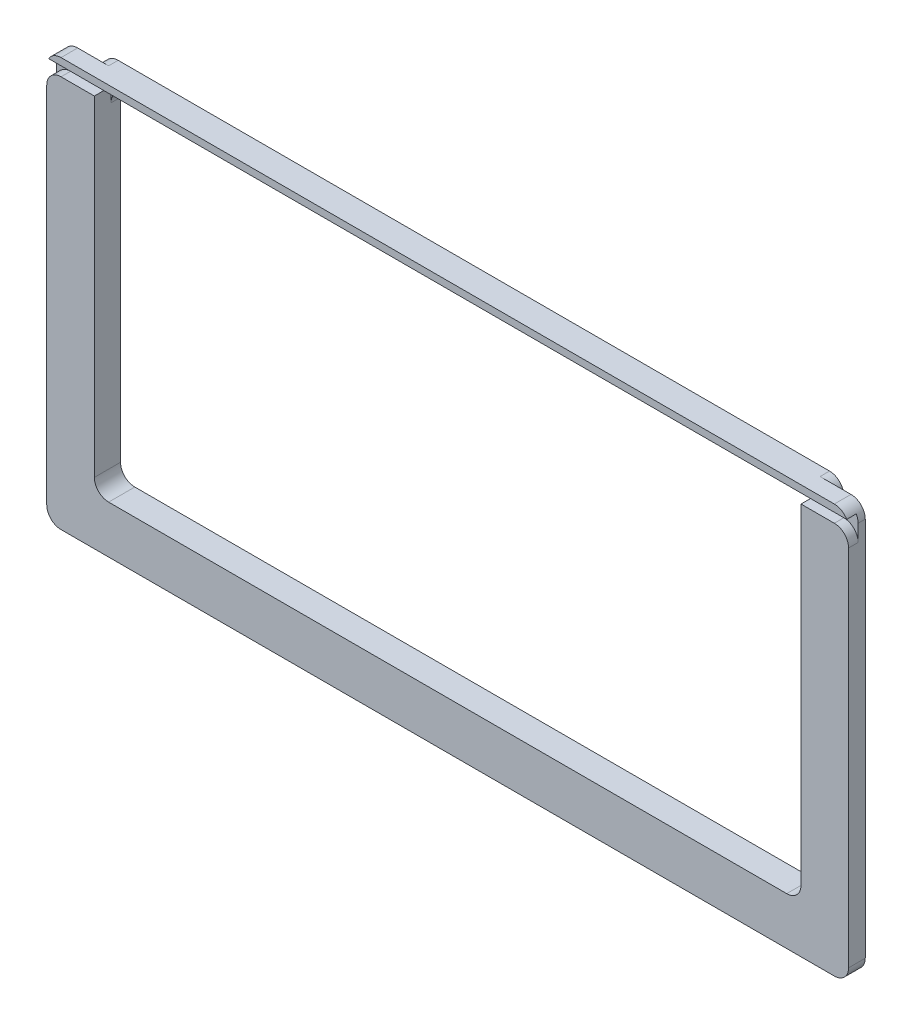
ISO-10303-21;
HEADER;
FILE_DESCRIPTION(('STEP AP214'),'2;1');
FILE_NAME('part.step','',(''),(''),'','','');
FILE_SCHEMA(('AUTOMOTIVE_DESIGN { 1 0 10303 214 1 1 1 1 }'));
ENDSEC;
DATA;
#1=APPLICATION_CONTEXT('core data for automotive mechanical design processes');
#2=APPLICATION_PROTOCOL_DEFINITION('international standard','automotive_design',2000,#1);
#3=PRODUCT_CONTEXT('',#1,'mechanical');
#4=PRODUCT('Part','Part','',(#3));
#5=PRODUCT_RELATED_PRODUCT_CATEGORY('part','',(#4));
#6=PRODUCT_DEFINITION_FORMATION('','',#4);
#7=PRODUCT_DEFINITION_CONTEXT('part definition',#1,'design');
#8=PRODUCT_DEFINITION('design','',#6,#7);
#9=PRODUCT_DEFINITION_SHAPE('','',#8);
#10=(LENGTH_UNIT() NAMED_UNIT(*) SI_UNIT(.MILLI.,.METRE.));
#11=(NAMED_UNIT(*) PLANE_ANGLE_UNIT() SI_UNIT($,.RADIAN.));
#12=(NAMED_UNIT(*) SI_UNIT($,.STERADIAN.) SOLID_ANGLE_UNIT());
#13=UNCERTAINTY_MEASURE_WITH_UNIT(LENGTH_MEASURE(1.E-05),#10,'distance_accuracy_value','');
#14=(GEOMETRIC_REPRESENTATION_CONTEXT(3) GLOBAL_UNCERTAINTY_ASSIGNED_CONTEXT((#13)) GLOBAL_UNIT_ASSIGNED_CONTEXT((#10,
#11,#12)) REPRESENTATION_CONTEXT('',''));
#15=CARTESIAN_POINT('',(0.,0.,0.));
#16=DIRECTION('',(0.,0.,1.));
#17=DIRECTION('',(1.,0.,0.));
#18=AXIS2_PLACEMENT_3D('',#15,#16,#17);
#19=CARTESIAN_POINT('',(0.,0.,3.5));
#20=DIRECTION('',(0.,0.,-1.));
#21=DIRECTION('',(-1.,0.,0.));
#22=AXIS2_PLACEMENT_3D('',#19,#20,#21);
#23=PLANE('',#22);
#24=DIRECTION('',(-1.,0.,0.));
#25=VECTOR('',#24,1.);
#26=CARTESIAN_POINT('',(84.245,42.95,3.5));
#27=LINE('',#26,#25);
#28=CARTESIAN_POINT('',(81.245,42.95,3.5));
#29=VERTEX_POINT('',#28);
#30=CARTESIAN_POINT('',(-81.245,42.95,3.5));
#31=VERTEX_POINT('',#30);
#32=EDGE_CURVE('E305',#29,#31,#27,.T.);
#33=ORIENTED_EDGE('',*,*,#32,.T.);
#34=CARTESIAN_POINT('',(-81.245,39.95,3.5));
#35=DIRECTION('',(0.,0.,-1.));
#36=DIRECTION('',(-1.,0.,0.));
#37=AXIS2_PLACEMENT_3D('',#34,#35,#36);
#38=CIRCLE('',#37,3.);
#39=CARTESIAN_POINT('',(-83.8430762113533,41.45,3.5));
#40=VERTEX_POINT('',#39);
#41=EDGE_CURVE('E368',#31,#40,#38,.F.);
#42=ORIENTED_EDGE('',*,*,#41,.T.);
#43=DIRECTION('',(1.,0.,0.));
#44=VECTOR('',#43,1.);
#45=CARTESIAN_POINT('',(-78.052886552932,41.45,3.5));
#46=LINE('',#45,#44);
#47=CARTESIAN_POINT('',(83.8430762113533,41.45,3.5));
#48=VERTEX_POINT('',#47);
#49=EDGE_CURVE('E269',#40,#48,#46,.T.);
#50=ORIENTED_EDGE('',*,*,#49,.T.);
#51=CARTESIAN_POINT('',(81.245,39.95,3.5));
#52=DIRECTION('',(0.,0.,-1.));
#53=DIRECTION('',(-1.,0.,0.));
#54=AXIS2_PLACEMENT_3D('',#51,#52,#53);
#55=CIRCLE('',#54,3.);
#56=EDGE_CURVE('E366',#48,#29,#55,.F.);
#57=ORIENTED_EDGE('',*,*,#56,.T.);
#58=EDGE_LOOP('',(#33,#42,#50,#57));
#59=FACE_BOUND('',#58,.T.);
#60=ADVANCED_FACE('F38',(#59),#23,.F.);
#61=CARTESIAN_POINT('',(-74.245,42.95,0.));
#62=DIRECTION('',(-1.,0.,0.));
#63=DIRECTION('',(0.,-1.,0.));
#64=AXIS2_PLACEMENT_3D('',#61,#62,#63);
#65=PLANE('',#64);
#66=DIRECTION('',(0.,1.,0.));
#67=VECTOR('',#66,1.);
#68=CARTESIAN_POINT('',(-74.245,39.45,-2.));
#69=LINE('',#68,#67);
#70=CARTESIAN_POINT('',(-74.245,-29.95,-2.));
#71=VERTEX_POINT('',#70);
#72=CARTESIAN_POINT('',(-74.245,36.45,-2.));
#73=VERTEX_POINT('',#72);
#74=EDGE_CURVE('E575',#71,#73,#69,.T.);
#75=ORIENTED_EDGE('',*,*,#74,.T.);
#76=DIRECTION('',(0.,0.,1.));
#77=VECTOR('',#76,1.);
#78=CARTESIAN_POINT('',(-74.245,36.45,0.));
#79=LINE('',#78,#77);
#80=CARTESIAN_POINT('',(-74.245,36.45,0.));
#81=VERTEX_POINT('',#80);
#82=EDGE_CURVE('E419',#73,#81,#79,.T.);
#83=ORIENTED_EDGE('',*,*,#82,.T.);
#84=DIRECTION('',(0.,-1.,0.));
#85=VECTOR('',#84,1.);
#86=CARTESIAN_POINT('',(-74.245,42.95,0.));
#87=LINE('',#86,#85);
#88=CARTESIAN_POINT('',(-74.245,41.45,0.));
#89=VERTEX_POINT('',#88);
#90=EDGE_CURVE('E281',#89,#81,#87,.T.);
#91=ORIENTED_EDGE('',*,*,#90,.F.);
#92=DIRECTION('',(0.,0.,1.));
#93=VECTOR('',#92,1.);
#94=CARTESIAN_POINT('',(-74.245,41.45,3.5));
#95=LINE('',#94,#93);
#96=CARTESIAN_POINT('',(-74.245,41.45,1.5));
#97=VERTEX_POINT('',#96);
#98=EDGE_CURVE('E267',#89,#97,#95,.T.);
#99=ORIENTED_EDGE('',*,*,#98,.T.);
#100=DIRECTION('',(0.,-1.,0.));
#101=VECTOR('',#100,1.);
#102=CARTESIAN_POINT('',(-74.245,42.95,1.5));
#103=LINE('',#102,#101);
#104=CARTESIAN_POINT('',(-74.245,39.45,1.5));
#105=VERTEX_POINT('',#104);
#106=EDGE_CURVE('E528',#97,#105,#103,.T.);
#107=ORIENTED_EDGE('',*,*,#106,.T.);
#108=DIRECTION('',(0.,0.,1.));
#109=VECTOR('',#108,1.);
#110=CARTESIAN_POINT('',(-74.245,39.45,0.));
#111=LINE('',#110,#109);
#112=CARTESIAN_POINT('',(-74.245,39.45,3.5));
#113=VERTEX_POINT('',#112);
#114=EDGE_CURVE('E533',#105,#113,#111,.T.);
#115=ORIENTED_EDGE('',*,*,#114,.T.);
#116=DIRECTION('',(0.,-1.,0.));
#117=VECTOR('',#116,1.);
#118=CARTESIAN_POINT('',(-74.245,42.95,3.5));
#119=LINE('',#118,#117);
#120=CARTESIAN_POINT('',(-74.245,-29.95,3.5));
#121=VERTEX_POINT('',#120);
#122=EDGE_CURVE('E289',#113,#121,#119,.T.);
#123=ORIENTED_EDGE('',*,*,#122,.T.);
#124=DIRECTION('',(0.,0.,1.));
#125=VECTOR('',#124,1.);
#126=CARTESIAN_POINT('',(-74.245,-29.95,-2.));
#127=LINE('',#126,#125);
#128=EDGE_CURVE('E417',#121,#71,#127,.F.);
#129=ORIENTED_EDGE('',*,*,#128,.T.);
#130=EDGE_LOOP('',(#75,#83,#91,#99,#107,#115,#123,#129));
#131=FACE_BOUND('',#130,.T.);
#132=ADVANCED_FACE('F470',(#131),#65,.F.);
#133=CARTESIAN_POINT('',(74.245,42.95,0.));
#134=DIRECTION('',(1.,0.,0.));
#135=DIRECTION('',(0.,1.,0.));
#136=AXIS2_PLACEMENT_3D('',#133,#134,#135);
#137=PLANE('',#136);
#138=DIRECTION('',(0.,-1.,0.));
#139=VECTOR('',#138,1.);
#140=CARTESIAN_POINT('',(74.245,39.45,-2.));
#141=LINE('',#140,#139);
#142=CARTESIAN_POINT('',(74.245,36.45,-2.));
#143=VERTEX_POINT('',#142);
#144=CARTESIAN_POINT('',(74.245,-29.95,-2.));
#145=VERTEX_POINT('',#144);
#146=EDGE_CURVE('E451',#143,#145,#141,.T.);
#147=ORIENTED_EDGE('',*,*,#146,.T.);
#148=DIRECTION('',(0.,0.,1.));
#149=VECTOR('',#148,1.);
#150=CARTESIAN_POINT('',(74.245,-29.95,3.5));
#151=LINE('',#150,#149);
#152=CARTESIAN_POINT('',(74.245,-29.95,3.5));
#153=VERTEX_POINT('',#152);
#154=EDGE_CURVE('E434',#145,#153,#151,.T.);
#155=ORIENTED_EDGE('',*,*,#154,.T.);
#156=DIRECTION('',(0.,1.,0.));
#157=VECTOR('',#156,1.);
#158=CARTESIAN_POINT('',(74.245,42.95,3.5));
#159=LINE('',#158,#157);
#160=CARTESIAN_POINT('',(74.245,39.45,3.5));
#161=VERTEX_POINT('',#160);
#162=EDGE_CURVE('E285',#153,#161,#159,.T.);
#163=ORIENTED_EDGE('',*,*,#162,.T.);
#164=DIRECTION('',(0.,0.,-1.));
#165=VECTOR('',#164,1.);
#166=CARTESIAN_POINT('',(74.245,39.45,0.));
#167=LINE('',#166,#165);
#168=CARTESIAN_POINT('',(74.245,39.45,1.5));
#169=VERTEX_POINT('',#168);
#170=EDGE_CURVE('E531',#161,#169,#167,.T.);
#171=ORIENTED_EDGE('',*,*,#170,.T.);
#172=DIRECTION('',(0.,1.,0.));
#173=VECTOR('',#172,1.);
#174=CARTESIAN_POINT('',(74.245,42.95,1.5));
#175=LINE('',#174,#173);
#176=CARTESIAN_POINT('',(74.245,41.45,1.5));
#177=VERTEX_POINT('',#176);
#178=EDGE_CURVE('E275',#169,#177,#175,.T.);
#179=ORIENTED_EDGE('',*,*,#178,.T.);
#180=DIRECTION('',(0.,0.,1.));
#181=VECTOR('',#180,1.);
#182=CARTESIAN_POINT('',(74.245,41.45,3.5));
#183=LINE('',#182,#181);
#184=CARTESIAN_POINT('',(74.245,41.45,0.));
#185=VERTEX_POINT('',#184);
#186=EDGE_CURVE('E265',#185,#177,#183,.T.);
#187=ORIENTED_EDGE('',*,*,#186,.F.);
#188=DIRECTION('',(0.,1.,0.));
#189=VECTOR('',#188,1.);
#190=CARTESIAN_POINT('',(74.245,42.95,0.));
#191=LINE('',#190,#189);
#192=CARTESIAN_POINT('',(74.245,36.45,0.));
#193=VERTEX_POINT('',#192);
#194=EDGE_CURVE('E53',#193,#185,#191,.T.);
#195=ORIENTED_EDGE('',*,*,#194,.F.);
#196=DIRECTION('',(0.,0.,1.));
#197=VECTOR('',#196,1.);
#198=CARTESIAN_POINT('',(74.245,36.45,0.));
#199=LINE('',#198,#197);
#200=EDGE_CURVE('E432',#193,#143,#199,.F.);
#201=ORIENTED_EDGE('',*,*,#200,.T.);
#202=EDGE_LOOP('',(#147,#155,#163,#171,#179,#187,#195,#201));
#203=FACE_BOUND('',#202,.T.);
#204=ADVANCED_FACE('F273',(#203),#137,.F.);
#205=CARTESIAN_POINT('',(-84.245,42.95,3.5));
#206=DIRECTION('',(1.,0.,0.));
#207=DIRECTION('',(0.,0.,-1.));
#208=AXIS2_PLACEMENT_3D('',#205,#206,#207);
#209=PLANE('',#208);
#210=DIRECTION('',(0.,1.,0.));
#211=VECTOR('',#210,1.);
#212=CARTESIAN_POINT('',(-84.245,42.95,1.5));
#213=LINE('',#212,#211);
#214=CARTESIAN_POINT('',(-84.245,36.45,1.5));
#215=VERTEX_POINT('',#214);
#216=CARTESIAN_POINT('',(-84.245,39.95,1.5));
#217=VERTEX_POINT('',#216);
#218=EDGE_CURVE('E523',#215,#217,#213,.T.);
#219=ORIENTED_EDGE('',*,*,#218,.T.);
#220=DIRECTION('',(0.,0.,-1.));
#221=VECTOR('',#220,1.);
#222=CARTESIAN_POINT('',(-84.245,39.95,3.5));
#223=LINE('',#222,#221);
#224=CARTESIAN_POINT('',(-84.245,39.95,0.));
#225=VERTEX_POINT('',#224);
#226=EDGE_CURVE('E354',#217,#225,#223,.T.);
#227=ORIENTED_EDGE('',*,*,#226,.T.);
#228=DIRECTION('',(0.,-1.,0.));
#229=VECTOR('',#228,1.);
#230=CARTESIAN_POINT('',(-84.245,42.95,0.));
#231=LINE('',#230,#229);
#232=CARTESIAN_POINT('',(-84.245,-39.95,0.));
#233=VERTEX_POINT('',#232);
#234=EDGE_CURVE('E280',#225,#233,#231,.T.);
#235=ORIENTED_EDGE('',*,*,#234,.T.);
#236=DIRECTION('',(0.,0.,-1.));
#237=VECTOR('',#236,1.);
#238=CARTESIAN_POINT('',(-84.245,-39.95,3.5));
#239=LINE('',#238,#237);
#240=CARTESIAN_POINT('',(-84.245,-39.95,3.5));
#241=VERTEX_POINT('',#240);
#242=EDGE_CURVE('E321',#233,#241,#239,.F.);
#243=ORIENTED_EDGE('',*,*,#242,.T.);
#244=DIRECTION('',(0.,-1.,0.));
#245=VECTOR('',#244,1.);
#246=CARTESIAN_POINT('',(-84.245,42.95,3.5));
#247=LINE('',#246,#245);
#248=CARTESIAN_POINT('',(-84.245,36.45,3.5));
#249=VERTEX_POINT('',#248);
#250=EDGE_CURVE('E296',#249,#241,#247,.T.);
#251=ORIENTED_EDGE('',*,*,#250,.F.);
#252=DIRECTION('',(0.,0.,-1.));
#253=VECTOR('',#252,1.);
#254=CARTESIAN_POINT('',(-84.245,36.45,3.5));
#255=LINE('',#254,#253);
#256=EDGE_CURVE('E337',#249,#215,#255,.T.);
#257=ORIENTED_EDGE('',*,*,#256,.T.);
#258=EDGE_LOOP('',(#219,#227,#235,#243,#251,#257));
#259=FACE_BOUND('',#258,.T.);
#260=ADVANCED_FACE('F625',(#259),#209,.F.);
#261=CARTESIAN_POINT('',(84.245,-42.95,3.5));
#262=DIRECTION('',(0.,1.,0.));
#263=DIRECTION('',(-1.,0.,0.));
#264=AXIS2_PLACEMENT_3D('',#261,#262,#263);
#265=PLANE('',#264);
#266=DIRECTION('',(1.,0.,0.));
#267=VECTOR('',#266,1.);
#268=CARTESIAN_POINT('',(84.245,-42.95,0.));
#269=LINE('',#268,#267);
#270=CARTESIAN_POINT('',(-81.245,-42.95,0.));
#271=VERTEX_POINT('',#270);
#272=CARTESIAN_POINT('',(81.245,-42.95,0.));
#273=VERTEX_POINT('',#272);
#274=EDGE_CURVE('E283',#271,#273,#269,.T.);
#275=ORIENTED_EDGE('',*,*,#274,.T.);
#276=DIRECTION('',(0.,0.,-1.));
#277=VECTOR('',#276,1.);
#278=CARTESIAN_POINT('',(81.245,-42.95,3.5));
#279=LINE('',#278,#277);
#280=CARTESIAN_POINT('',(81.245,-42.95,3.5));
#281=VERTEX_POINT('',#280);
#282=EDGE_CURVE('E331',#273,#281,#279,.F.);
#283=ORIENTED_EDGE('',*,*,#282,.T.);
#284=DIRECTION('',(1.,0.,0.));
#285=VECTOR('',#284,1.);
#286=CARTESIAN_POINT('',(84.245,-42.95,3.5));
#287=LINE('',#286,#285);
#288=CARTESIAN_POINT('',(-81.245,-42.95,3.5));
#289=VERTEX_POINT('',#288);
#290=EDGE_CURVE('E298',#289,#281,#287,.T.);
#291=ORIENTED_EDGE('',*,*,#290,.F.);
#292=DIRECTION('',(0.,0.,-1.));
#293=VECTOR('',#292,1.);
#294=CARTESIAN_POINT('',(-81.245,-42.95,3.5));
#295=LINE('',#294,#293);
#296=EDGE_CURVE('E307',#289,#271,#295,.T.);
#297=ORIENTED_EDGE('',*,*,#296,.T.);
#298=EDGE_LOOP('',(#275,#283,#291,#297));
#299=FACE_BOUND('',#298,.T.);
#300=ADVANCED_FACE('F633',(#299),#265,.F.);
#301=CARTESIAN_POINT('',(84.245,42.95,3.5));
#302=DIRECTION('',(-1.,0.,0.));
#303=DIRECTION('',(0.,0.,1.));
#304=AXIS2_PLACEMENT_3D('',#301,#302,#303);
#305=PLANE('',#304);
#306=DIRECTION('',(0.,1.,0.));
#307=VECTOR('',#306,1.);
#308=CARTESIAN_POINT('',(84.245,42.95,0.));
#309=LINE('',#308,#307);
#310=CARTESIAN_POINT('',(84.245,-39.95,0.));
#311=VERTEX_POINT('',#310);
#312=CARTESIAN_POINT('',(84.245,39.95,0.));
#313=VERTEX_POINT('',#312);
#314=EDGE_CURVE('E311',#311,#313,#309,.T.);
#315=ORIENTED_EDGE('',*,*,#314,.T.);
#316=DIRECTION('',(0.,0.,-1.));
#317=VECTOR('',#316,1.);
#318=CARTESIAN_POINT('',(84.245,39.95,3.5));
#319=LINE('',#318,#317);
#320=CARTESIAN_POINT('',(84.245,39.95,1.5));
#321=VERTEX_POINT('',#320);
#322=EDGE_CURVE('E376',#313,#321,#319,.F.);
#323=ORIENTED_EDGE('',*,*,#322,.T.);
#324=DIRECTION('',(0.,1.,0.));
#325=VECTOR('',#324,1.);
#326=CARTESIAN_POINT('',(84.245,41.45,1.5));
#327=LINE('',#326,#325);
#328=CARTESIAN_POINT('',(84.245,36.45,1.5));
#329=VERTEX_POINT('',#328);
#330=EDGE_CURVE('E522',#329,#321,#327,.T.);
#331=ORIENTED_EDGE('',*,*,#330,.F.);
#332=DIRECTION('',(0.,0.,-1.));
#333=VECTOR('',#332,1.);
#334=CARTESIAN_POINT('',(84.245,36.45,3.5));
#335=LINE('',#334,#333);
#336=CARTESIAN_POINT('',(84.245,36.45,3.5));
#337=VERTEX_POINT('',#336);
#338=EDGE_CURVE('E347',#329,#337,#335,.F.);
#339=ORIENTED_EDGE('',*,*,#338,.T.);
#340=DIRECTION('',(0.,1.,0.));
#341=VECTOR('',#340,1.);
#342=CARTESIAN_POINT('',(84.245,42.95,3.5));
#343=LINE('',#342,#341);
#344=CARTESIAN_POINT('',(84.245,-39.95,3.5));
#345=VERTEX_POINT('',#344);
#346=EDGE_CURVE('E302',#345,#337,#343,.T.);
#347=ORIENTED_EDGE('',*,*,#346,.F.);
#348=DIRECTION('',(0.,0.,-1.));
#349=VECTOR('',#348,1.);
#350=CARTESIAN_POINT('',(84.245,-39.95,3.5));
#351=LINE('',#350,#349);
#352=EDGE_CURVE('E326',#345,#311,#351,.T.);
#353=ORIENTED_EDGE('',*,*,#352,.T.);
#354=EDGE_LOOP('',(#315,#323,#331,#339,#347,#353));
#355=FACE_BOUND('',#354,.T.);
#356=ADVANCED_FACE('F490',(#355),#305,.F.);
#357=CARTESIAN_POINT('',(84.245,42.95,3.5));
#358=DIRECTION('',(0.,-1.,0.));
#359=DIRECTION('',(1.,0.,0.));
#360=AXIS2_PLACEMENT_3D('',#357,#358,#359);
#361=PLANE('',#360);
#362=DIRECTION('',(-1.,0.,0.));
#363=VECTOR('',#362,1.);
#364=CARTESIAN_POINT('',(84.245,42.95,0.));
#365=LINE('',#364,#363);
#366=CARTESIAN_POINT('',(81.245,42.95,0.));
#367=VERTEX_POINT('',#366);
#368=CARTESIAN_POINT('',(74.745,42.95,0.));
#369=VERTEX_POINT('',#368);
#370=EDGE_CURVE('E299',#367,#369,#365,.T.);
#371=ORIENTED_EDGE('',*,*,#370,.T.);
#372=DIRECTION('',(0.,0.,1.));
#373=VECTOR('',#372,1.);
#374=CARTESIAN_POINT('',(74.745,42.95,3.5));
#375=LINE('',#374,#373);
#376=CARTESIAN_POINT('',(74.745,42.95,-2.));
#377=VERTEX_POINT('',#376);
#378=EDGE_CURVE('E388',#369,#377,#375,.F.);
#379=ORIENTED_EDGE('',*,*,#378,.T.);
#380=DIRECTION('',(1.,0.,0.));
#381=VECTOR('',#380,1.);
#382=CARTESIAN_POINT('',(77.745,42.95,-2.));
#383=LINE('',#382,#381);
#384=CARTESIAN_POINT('',(-74.745,42.95,-2.));
#385=VERTEX_POINT('',#384);
#386=EDGE_CURVE('E560',#385,#377,#383,.T.);
#387=ORIENTED_EDGE('',*,*,#386,.F.);
#388=DIRECTION('',(0.,0.,1.));
#389=VECTOR('',#388,1.);
#390=CARTESIAN_POINT('',(-74.745,42.95,3.5));
#391=LINE('',#390,#389);
#392=CARTESIAN_POINT('',(-74.745,42.95,0.));
#393=VERTEX_POINT('',#392);
#394=EDGE_CURVE('E385',#385,#393,#391,.T.);
#395=ORIENTED_EDGE('',*,*,#394,.T.);
#396=CARTESIAN_POINT('',(-81.245,42.95,0.));
#397=VERTEX_POINT('',#396);
#398=EDGE_CURVE('E314',#393,#397,#365,.T.);
#399=ORIENTED_EDGE('',*,*,#398,.T.);
#400=DIRECTION('',(0.,0.,-1.));
#401=VECTOR('',#400,1.);
#402=CARTESIAN_POINT('',(-81.245,42.95,3.5));
#403=LINE('',#402,#401);
#404=EDGE_CURVE('E364',#397,#31,#403,.F.);
#405=ORIENTED_EDGE('',*,*,#404,.T.);
#406=ORIENTED_EDGE('',*,*,#32,.F.);
#407=DIRECTION('',(0.,0.,-1.));
#408=VECTOR('',#407,1.);
#409=CARTESIAN_POINT('',(81.245,42.95,3.5));
#410=LINE('',#409,#408);
#411=EDGE_CURVE('E361',#29,#367,#410,.T.);
#412=ORIENTED_EDGE('',*,*,#411,.T.);
#413=EDGE_LOOP('',(#371,#379,#387,#395,#399,#405,#406,#412));
#414=FACE_BOUND('',#413,.T.);
#415=ADVANCED_FACE('F482',(#414),#361,.F.);
#416=ORIENTED_EDGE('',*,*,#346,.T.);
#417=CARTESIAN_POINT('',(81.245,36.45,3.5));
#418=DIRECTION('',(0.,0.,-1.));
#419=DIRECTION('',(-1.,0.,0.));
#420=AXIS2_PLACEMENT_3D('',#417,#418,#419);
#421=CIRCLE('',#420,3.);
#422=CARTESIAN_POINT('',(81.245,39.45,3.5));
#423=VERTEX_POINT('',#422);
#424=EDGE_CURVE('E349',#337,#423,#421,.F.);
#425=ORIENTED_EDGE('',*,*,#424,.T.);
#426=DIRECTION('',(1.,0.,0.));
#427=VECTOR('',#426,1.);
#428=CARTESIAN_POINT('',(-92.2550000000001,39.45,3.5));
#429=LINE('',#428,#427);
#430=EDGE_CURVE('E510',#161,#423,#429,.T.);
#431=ORIENTED_EDGE('',*,*,#430,.F.);
#432=ORIENTED_EDGE('',*,*,#162,.F.);
#433=CARTESIAN_POINT('',(71.245,-29.95,3.5));
#434=DIRECTION('',(0.,0.,-1.));
#435=DIRECTION('',(-1.,0.,0.));
#436=AXIS2_PLACEMENT_3D('',#433,#434,#435);
#437=CIRCLE('',#436,3.);
#438=CARTESIAN_POINT('',(71.245,-32.95,3.5));
#439=VERTEX_POINT('',#438);
#440=EDGE_CURVE('E61',#153,#439,#437,.T.);
#441=ORIENTED_EDGE('',*,*,#440,.T.);
#442=DIRECTION('',(1.,0.,0.));
#443=VECTOR('',#442,1.);
#444=CARTESIAN_POINT('',(-74.245,-32.95,3.5));
#445=LINE('',#444,#443);
#446=CARTESIAN_POINT('',(-71.245,-32.95,3.5));
#447=VERTEX_POINT('',#446);
#448=EDGE_CURVE('E292',#447,#439,#445,.T.);
#449=ORIENTED_EDGE('',*,*,#448,.F.);
#450=CARTESIAN_POINT('',(-71.245,-29.95,3.5));
#451=DIRECTION('',(0.,0.,-1.));
#452=DIRECTION('',(-1.,0.,0.));
#453=AXIS2_PLACEMENT_3D('',#450,#451,#452);
#454=CIRCLE('',#453,3.);
#455=EDGE_CURVE('E440',#447,#121,#454,.T.);
#456=ORIENTED_EDGE('',*,*,#455,.T.);
#457=ORIENTED_EDGE('',*,*,#122,.F.);
#458=CARTESIAN_POINT('',(-81.245,39.45,3.5));
#459=VERTEX_POINT('',#458);
#460=EDGE_CURVE('E515',#459,#113,#429,.T.);
#461=ORIENTED_EDGE('',*,*,#460,.F.);
#462=CARTESIAN_POINT('',(-81.245,36.45,3.5));
#463=DIRECTION('',(0.,0.,-1.));
#464=DIRECTION('',(-1.,0.,0.));
#465=AXIS2_PLACEMENT_3D('',#462,#463,#464);
#466=CIRCLE('',#465,3.);
#467=EDGE_CURVE('E333',#459,#249,#466,.F.);
#468=ORIENTED_EDGE('',*,*,#467,.T.);
#469=ORIENTED_EDGE('',*,*,#250,.T.);
#470=CARTESIAN_POINT('',(-81.245,-39.95,3.5));
#471=DIRECTION('',(0.,0.,-1.));
#472=DIRECTION('',(-1.,0.,0.));
#473=AXIS2_PLACEMENT_3D('',#470,#471,#472);
#474=CIRCLE('',#473,3.);
#475=EDGE_CURVE('E324',#241,#289,#474,.F.);
#476=ORIENTED_EDGE('',*,*,#475,.T.);
#477=ORIENTED_EDGE('',*,*,#290,.T.);
#478=CARTESIAN_POINT('',(81.245,-39.95,3.5));
#479=DIRECTION('',(0.,0.,-1.));
#480=DIRECTION('',(-1.,0.,0.));
#481=AXIS2_PLACEMENT_3D('',#478,#479,#480);
#482=CIRCLE('',#481,3.);
#483=EDGE_CURVE('E335',#281,#345,#482,.F.);
#484=ORIENTED_EDGE('',*,*,#483,.T.);
#485=EDGE_LOOP('',(#416,#425,#431,#432,#441,#449,#456,#457,#461,#468,#469,#476,#477,#484));
#486=FACE_BOUND('',#485,.T.);
#487=ADVANCED_FACE('F473',(#486),#23,.F.);
#488=CARTESIAN_POINT('',(0.,0.,0.));
#489=DIRECTION('',(0.,0.,-1.));
#490=DIRECTION('',(-1.,0.,0.));
#491=AXIS2_PLACEMENT_3D('',#488,#489,#490);
#492=PLANE('',#491);
#493=ORIENTED_EDGE('',*,*,#234,.F.);
#494=CARTESIAN_POINT('',(-81.245,39.95,0.));
#495=DIRECTION('',(0.,0.,-1.));
#496=DIRECTION('',(-1.,0.,0.));
#497=AXIS2_PLACEMENT_3D('',#494,#495,#496);
#498=CIRCLE('',#497,3.);
#499=EDGE_CURVE('E359',#225,#397,#498,.T.);
#500=ORIENTED_EDGE('',*,*,#499,.T.);
#501=ORIENTED_EDGE('',*,*,#398,.F.);
#502=CARTESIAN_POINT('',(-74.745,39.95,0.));
#503=DIRECTION('',(0.,0.,-1.));
#504=DIRECTION('',(-1.,0.,0.));
#505=AXIS2_PLACEMENT_3D('',#502,#503,#504);
#506=CIRCLE('',#505,3.);
#507=CARTESIAN_POINT('',(-77.745,39.95,0.));
#508=VERTEX_POINT('',#507);
#509=EDGE_CURVE('E411',#393,#508,#506,.F.);
#510=ORIENTED_EDGE('',*,*,#509,.T.);
#511=DIRECTION('',(0.,1.,0.));
#512=VECTOR('',#511,1.);
#513=CARTESIAN_POINT('',(-77.745,42.95,0.));
#514=LINE('',#513,#512);
#515=CARTESIAN_POINT('',(-77.745,-33.45,0.));
#516=VERTEX_POINT('',#515);
#517=EDGE_CURVE('E578',#516,#508,#514,.T.);
#518=ORIENTED_EDGE('',*,*,#517,.F.);
#519=CARTESIAN_POINT('',(-74.745,-33.45,0.));
#520=DIRECTION('',(0.,0.,-1.));
#521=DIRECTION('',(-1.,0.,0.));
#522=AXIS2_PLACEMENT_3D('',#519,#520,#521);
#523=CIRCLE('',#522,3.);
#524=CARTESIAN_POINT('',(-74.745,-36.45,0.));
#525=VERTEX_POINT('',#524);
#526=EDGE_CURVE('E413',#516,#525,#523,.F.);
#527=ORIENTED_EDGE('',*,*,#526,.T.);
#528=DIRECTION('',(-1.,0.,0.));
#529=VECTOR('',#528,1.);
#530=CARTESIAN_POINT('',(77.745,-36.45,0.));
#531=LINE('',#530,#529);
#532=CARTESIAN_POINT('',(74.745,-36.45,0.));
#533=VERTEX_POINT('',#532);
#534=EDGE_CURVE('E574',#533,#525,#531,.T.);
#535=ORIENTED_EDGE('',*,*,#534,.F.);
#536=CARTESIAN_POINT('',(74.745,-33.45,0.));
#537=DIRECTION('',(0.,0.,-1.));
#538=DIRECTION('',(-1.,0.,0.));
#539=AXIS2_PLACEMENT_3D('',#536,#537,#538);
#540=CIRCLE('',#539,3.);
#541=CARTESIAN_POINT('',(77.745,-33.45,0.));
#542=VERTEX_POINT('',#541);
#543=EDGE_CURVE('E415',#533,#542,#540,.F.);
#544=ORIENTED_EDGE('',*,*,#543,.T.);
#545=DIRECTION('',(0.,-1.,0.));
#546=VECTOR('',#545,1.);
#547=CARTESIAN_POINT('',(77.745,42.95,0.));
#548=LINE('',#547,#546);
#549=CARTESIAN_POINT('',(77.745,39.95,0.));
#550=VERTEX_POINT('',#549);
#551=EDGE_CURVE('E553',#550,#542,#548,.T.);
#552=ORIENTED_EDGE('',*,*,#551,.F.);
#553=CARTESIAN_POINT('',(74.745,39.95,0.));
#554=DIRECTION('',(0.,0.,-1.));
#555=DIRECTION('',(-1.,0.,0.));
#556=AXIS2_PLACEMENT_3D('',#553,#554,#555);
#557=CIRCLE('',#556,3.);
#558=EDGE_CURVE('E408',#550,#369,#557,.F.);
#559=ORIENTED_EDGE('',*,*,#558,.T.);
#560=ORIENTED_EDGE('',*,*,#370,.F.);
#561=CARTESIAN_POINT('',(81.245,39.95,0.));
#562=DIRECTION('',(0.,0.,-1.));
#563=DIRECTION('',(-1.,0.,0.));
#564=AXIS2_PLACEMENT_3D('',#561,#562,#563);
#565=CIRCLE('',#564,3.);
#566=EDGE_CURVE('E357',#367,#313,#565,.T.);
#567=ORIENTED_EDGE('',*,*,#566,.T.);
#568=ORIENTED_EDGE('',*,*,#314,.F.);
#569=CARTESIAN_POINT('',(81.245,-39.95,0.));
#570=DIRECTION('',(0.,0.,-1.));
#571=DIRECTION('',(-1.,0.,0.));
#572=AXIS2_PLACEMENT_3D('',#569,#570,#571);
#573=CIRCLE('',#572,3.);
#574=EDGE_CURVE('E329',#311,#273,#573,.T.);
#575=ORIENTED_EDGE('',*,*,#574,.T.);
#576=ORIENTED_EDGE('',*,*,#274,.F.);
#577=CARTESIAN_POINT('',(-81.245,-39.95,0.));
#578=DIRECTION('',(0.,0.,-1.));
#579=DIRECTION('',(-1.,0.,0.));
#580=AXIS2_PLACEMENT_3D('',#577,#578,#579);
#581=CIRCLE('',#580,3.);
#582=EDGE_CURVE('E318',#271,#233,#581,.T.);
#583=ORIENTED_EDGE('',*,*,#582,.T.);
#584=EDGE_LOOP('',(#493,#500,#501,#510,#518,#527,#535,#544,#552,#559,#560,#567,#568,#575,#576,#583));
#585=FACE_BOUND('',#584,.T.);
#586=ADVANCED_FACE('F481',(#585),#492,.T.);
#587=CARTESIAN_POINT('',(-74.245,-32.95,0.));
#588=DIRECTION('',(0.,-1.,0.));
#589=DIRECTION('',(0.,0.,-1.));
#590=AXIS2_PLACEMENT_3D('',#587,#588,#589);
#591=PLANE('',#590);
#592=DIRECTION('',(-1.,0.,0.));
#593=VECTOR('',#592,1.);
#594=CARTESIAN_POINT('',(74.245,-32.95,-2.));
#595=LINE('',#594,#593);
#596=CARTESIAN_POINT('',(71.245,-32.95,-2.));
#597=VERTEX_POINT('',#596);
#598=CARTESIAN_POINT('',(-71.245,-32.95,-2.));
#599=VERTEX_POINT('',#598);
#600=EDGE_CURVE('E454',#597,#599,#595,.T.);
#601=ORIENTED_EDGE('',*,*,#600,.T.);
#602=DIRECTION('',(0.,0.,1.));
#603=VECTOR('',#602,1.);
#604=CARTESIAN_POINT('',(-71.245,-32.95,3.5));
#605=LINE('',#604,#603);
#606=EDGE_CURVE('E429',#599,#447,#605,.T.);
#607=ORIENTED_EDGE('',*,*,#606,.T.);
#608=ORIENTED_EDGE('',*,*,#448,.T.);
#609=DIRECTION('',(0.,0.,1.));
#610=VECTOR('',#609,1.);
#611=CARTESIAN_POINT('',(71.245,-32.95,-2.));
#612=LINE('',#611,#610);
#613=EDGE_CURVE('E427',#439,#597,#612,.F.);
#614=ORIENTED_EDGE('',*,*,#613,.T.);
#615=EDGE_LOOP('',(#601,#607,#608,#614));
#616=FACE_BOUND('',#615,.T.);
#617=ADVANCED_FACE('F488',(#616),#591,.F.);
#618=CARTESIAN_POINT('',(-78.052886552932,41.45,3.5));
#619=DIRECTION('',(0.,1.,0.));
#620=DIRECTION('',(-1.,0.,0.));
#621=AXIS2_PLACEMENT_3D('',#618,#619,#620);
#622=PLANE('',#621);
#623=ORIENTED_EDGE('',*,*,#49,.F.);
#624=DIRECTION('',(0.,0.,-1.));
#625=VECTOR('',#624,1.);
#626=CARTESIAN_POINT('',(-83.8430762113533,41.45,3.5));
#627=LINE('',#626,#625);
#628=CARTESIAN_POINT('',(-83.8430762113533,41.45,1.5));
#629=VERTEX_POINT('',#628);
#630=EDGE_CURVE('E372',#40,#629,#627,.T.);
#631=ORIENTED_EDGE('',*,*,#630,.T.);
#632=DIRECTION('',(1.,0.,0.));
#633=VECTOR('',#632,1.);
#634=CARTESIAN_POINT('',(-92.2550000000001,41.45,1.5));
#635=LINE('',#634,#633);
#636=EDGE_CURVE('E526',#629,#97,#635,.T.);
#637=ORIENTED_EDGE('',*,*,#636,.T.);
#638=ORIENTED_EDGE('',*,*,#98,.F.);
#639=DIRECTION('',(1.,0.,0.));
#640=VECTOR('',#639,1.);
#641=CARTESIAN_POINT('',(-78.052886552932,41.45,0.));
#642=LINE('',#641,#640);
#643=EDGE_CURVE('E261',#89,#185,#642,.T.);
#644=ORIENTED_EDGE('',*,*,#643,.T.);
#645=ORIENTED_EDGE('',*,*,#186,.T.);
#646=CARTESIAN_POINT('',(83.8430762113533,41.45,1.5));
#647=VERTEX_POINT('',#646);
#648=EDGE_CURVE('E517',#177,#647,#635,.T.);
#649=ORIENTED_EDGE('',*,*,#648,.T.);
#650=DIRECTION('',(0.,0.,-1.));
#651=VECTOR('',#650,1.);
#652=CARTESIAN_POINT('',(83.8430762113533,41.45,1.5));
#653=LINE('',#652,#651);
#654=EDGE_CURVE('E370',#647,#48,#653,.F.);
#655=ORIENTED_EDGE('',*,*,#654,.T.);
#656=EDGE_LOOP('',(#623,#631,#637,#638,#644,#645,#649,#655));
#657=FACE_BOUND('',#656,.T.);
#658=ADVANCED_FACE('F263',(#657),#622,.F.);
#659=CARTESIAN_POINT('',(-92.2550000000001,39.45,3.5));
#660=DIRECTION('',(0.,-1.,0.));
#661=DIRECTION('',(0.,0.,-1.));
#662=AXIS2_PLACEMENT_3D('',#659,#660,#661);
#663=PLANE('',#662);
#664=DIRECTION('',(1.,0.,0.));
#665=VECTOR('',#664,1.);
#666=CARTESIAN_POINT('',(-92.2550000000001,39.45,1.5));
#667=LINE('',#666,#665);
#668=CARTESIAN_POINT('',(-81.245,39.45,1.5));
#669=VERTEX_POINT('',#668);
#670=EDGE_CURVE('E514',#669,#105,#667,.T.);
#671=ORIENTED_EDGE('',*,*,#670,.F.);
#672=DIRECTION('',(0.,0.,-1.));
#673=VECTOR('',#672,1.);
#674=CARTESIAN_POINT('',(-81.245,39.45,3.5));
#675=LINE('',#674,#673);
#676=EDGE_CURVE('E340',#669,#459,#675,.F.);
#677=ORIENTED_EDGE('',*,*,#676,.T.);
#678=ORIENTED_EDGE('',*,*,#460,.T.);
#679=ORIENTED_EDGE('',*,*,#114,.F.);
#680=EDGE_LOOP('',(#671,#677,#678,#679));
#681=FACE_BOUND('',#680,.T.);
#682=ADVANCED_FACE('F616',(#681),#663,.F.);
#683=CARTESIAN_POINT('',(-92.2550000000001,41.45,1.5));
#684=DIRECTION('',(0.,0.,-1.));
#685=DIRECTION('',(0.,1.,0.));
#686=AXIS2_PLACEMENT_3D('',#683,#684,#685);
#687=PLANE('',#686);
#688=ORIENTED_EDGE('',*,*,#636,.F.);
#689=CARTESIAN_POINT('',(-81.245,39.95,1.5));
#690=DIRECTION('',(0.,0.,-1.));
#691=DIRECTION('',(0.,1.,0.));
#692=AXIS2_PLACEMENT_3D('',#689,#690,#691);
#693=CIRCLE('',#692,3.);
#694=EDGE_CURVE('E374',#629,#217,#693,.F.);
#695=ORIENTED_EDGE('',*,*,#694,.T.);
#696=ORIENTED_EDGE('',*,*,#218,.F.);
#697=CARTESIAN_POINT('',(-81.245,36.45,1.5));
#698=DIRECTION('',(0.,0.,-1.));
#699=DIRECTION('',(0.,1.,0.));
#700=AXIS2_PLACEMENT_3D('',#697,#698,#699);
#701=CIRCLE('',#700,3.);
#702=EDGE_CURVE('E342',#215,#669,#701,.T.);
#703=ORIENTED_EDGE('',*,*,#702,.T.);
#704=ORIENTED_EDGE('',*,*,#670,.T.);
#705=ORIENTED_EDGE('',*,*,#106,.F.);
#706=EDGE_LOOP('',(#688,#695,#696,#703,#704,#705));
#707=FACE_BOUND('',#706,.T.);
#708=ADVANCED_FACE('F642',(#707),#687,.F.);
#709=ORIENTED_EDGE('',*,*,#430,.T.);
#710=DIRECTION('',(0.,0.,-1.));
#711=VECTOR('',#710,1.);
#712=CARTESIAN_POINT('',(81.245,39.45,3.5));
#713=LINE('',#712,#711);
#714=CARTESIAN_POINT('',(81.245,39.45,1.5));
#715=VERTEX_POINT('',#714);
#716=EDGE_CURVE('E344',#423,#715,#713,.T.);
#717=ORIENTED_EDGE('',*,*,#716,.T.);
#718=EDGE_CURVE('E509',#169,#715,#667,.T.);
#719=ORIENTED_EDGE('',*,*,#718,.F.);
#720=ORIENTED_EDGE('',*,*,#170,.F.);
#721=EDGE_LOOP('',(#709,#717,#719,#720));
#722=FACE_BOUND('',#721,.T.);
#723=ADVANCED_FACE('F507',(#722),#663,.F.);
#724=ORIENTED_EDGE('',*,*,#330,.T.);
#725=CARTESIAN_POINT('',(81.245,39.95,1.5));
#726=DIRECTION('',(0.,0.,-1.));
#727=DIRECTION('',(0.,1.,0.));
#728=AXIS2_PLACEMENT_3D('',#725,#726,#727);
#729=CIRCLE('',#728,3.);
#730=EDGE_CURVE('E378',#321,#647,#729,.F.);
#731=ORIENTED_EDGE('',*,*,#730,.T.);
#732=ORIENTED_EDGE('',*,*,#648,.F.);
#733=ORIENTED_EDGE('',*,*,#178,.F.);
#734=ORIENTED_EDGE('',*,*,#718,.T.);
#735=CARTESIAN_POINT('',(81.245,36.45,1.5));
#736=DIRECTION('',(0.,0.,-1.));
#737=DIRECTION('',(0.,1.,0.));
#738=AXIS2_PLACEMENT_3D('',#735,#736,#737);
#739=CIRCLE('',#738,3.);
#740=EDGE_CURVE('E351',#715,#329,#739,.T.);
#741=ORIENTED_EDGE('',*,*,#740,.T.);
#742=EDGE_LOOP('',(#724,#731,#732,#733,#734,#741));
#743=FACE_BOUND('',#742,.T.);
#744=ADVANCED_FACE('F513',(#743),#687,.F.);
#745=CARTESIAN_POINT('',(-81.245,-39.95,3.5));
#746=DIRECTION('',(0.,0.,-1.));
#747=DIRECTION('',(-1.,0.,0.));
#748=AXIS2_PLACEMENT_3D('',#745,#746,#747);
#749=CYLINDRICAL_SURFACE('',#748,3.);
#750=ORIENTED_EDGE('',*,*,#475,.F.);
#751=ORIENTED_EDGE('',*,*,#242,.F.);
#752=ORIENTED_EDGE('',*,*,#582,.F.);
#753=ORIENTED_EDGE('',*,*,#296,.F.);
#754=EDGE_LOOP('',(#750,#751,#752,#753));
#755=FACE_BOUND('',#754,.T.);
#756=ADVANCED_FACE('F636',(#755),#749,.T.);
#757=CARTESIAN_POINT('',(81.245,-39.95,3.5));
#758=DIRECTION('',(0.,0.,-1.));
#759=DIRECTION('',(-1.,0.,0.));
#760=AXIS2_PLACEMENT_3D('',#757,#758,#759);
#761=CYLINDRICAL_SURFACE('',#760,3.);
#762=ORIENTED_EDGE('',*,*,#483,.F.);
#763=ORIENTED_EDGE('',*,*,#282,.F.);
#764=ORIENTED_EDGE('',*,*,#574,.F.);
#765=ORIENTED_EDGE('',*,*,#352,.F.);
#766=EDGE_LOOP('',(#762,#763,#764,#765));
#767=FACE_BOUND('',#766,.T.);
#768=ADVANCED_FACE('F638',(#767),#761,.T.);
#769=CARTESIAN_POINT('',(-81.245,36.45,3.5));
#770=DIRECTION('',(0.,0.,-1.));
#771=DIRECTION('',(-1.,0.,0.));
#772=AXIS2_PLACEMENT_3D('',#769,#770,#771);
#773=CYLINDRICAL_SURFACE('',#772,3.);
#774=ORIENTED_EDGE('',*,*,#467,.F.);
#775=ORIENTED_EDGE('',*,*,#676,.F.);
#776=ORIENTED_EDGE('',*,*,#702,.F.);
#777=ORIENTED_EDGE('',*,*,#256,.F.);
#778=EDGE_LOOP('',(#774,#775,#776,#777));
#779=FACE_BOUND('',#778,.T.);
#780=ADVANCED_FACE('F622',(#779),#773,.T.);
#781=CARTESIAN_POINT('',(0.,0.,0.));
#782=DIRECTION('',(0.,0.,-1.));
#783=DIRECTION('',(-1.,0.,0.));
#784=AXIS2_PLACEMENT_3D('',#781,#782,#783);
#785=PLANE('',#784);
#786=ORIENTED_EDGE('',*,*,#643,.F.);
#787=ORIENTED_EDGE('',*,*,#90,.T.);
#788=CARTESIAN_POINT('',(-71.245,36.45,0.));
#789=DIRECTION('',(0.,0.,-1.));
#790=DIRECTION('',(-1.,0.,0.));
#791=AXIS2_PLACEMENT_3D('',#788,#789,#790);
#792=CIRCLE('',#791,3.);
#793=CARTESIAN_POINT('',(-71.245,39.45,0.));
#794=VERTEX_POINT('',#793);
#795=EDGE_CURVE('E436',#81,#794,#792,.T.);
#796=ORIENTED_EDGE('',*,*,#795,.T.);
#797=DIRECTION('',(1.,0.,0.));
#798=VECTOR('',#797,1.);
#799=CARTESIAN_POINT('',(74.245,39.45,0.));
#800=LINE('',#799,#798);
#801=CARTESIAN_POINT('',(71.245,39.45,0.));
#802=VERTEX_POINT('',#801);
#803=EDGE_CURVE('E588',#794,#802,#800,.T.);
#804=ORIENTED_EDGE('',*,*,#803,.T.);
#805=CARTESIAN_POINT('',(71.245,36.45,0.));
#806=DIRECTION('',(0.,0.,-1.));
#807=DIRECTION('',(-1.,0.,0.));
#808=AXIS2_PLACEMENT_3D('',#805,#806,#807);
#809=CIRCLE('',#808,3.);
#810=EDGE_CURVE('E46',#802,#193,#809,.T.);
#811=ORIENTED_EDGE('',*,*,#810,.T.);
#812=ORIENTED_EDGE('',*,*,#194,.T.);
#813=EDGE_LOOP('',(#786,#787,#796,#804,#811,#812));
#814=FACE_BOUND('',#813,.T.);
#815=ADVANCED_FACE('F277',(#814),#785,.F.);
#816=CARTESIAN_POINT('',(0.,0.,-2.));
#817=DIRECTION('',(0.,0.,-1.));
#818=DIRECTION('',(-1.,0.,0.));
#819=AXIS2_PLACEMENT_3D('',#816,#817,#818);
#820=PLANE('',#819);
#821=ORIENTED_EDGE('',*,*,#386,.T.);
#822=CARTESIAN_POINT('',(74.745,39.95,-2.));
#823=DIRECTION('',(0.,0.,-1.));
#824=DIRECTION('',(-1.,0.,0.));
#825=AXIS2_PLACEMENT_3D('',#822,#823,#824);
#826=CIRCLE('',#825,3.);
#827=CARTESIAN_POINT('',(77.745,39.95,-2.));
#828=VERTEX_POINT('',#827);
#829=EDGE_CURVE('E396',#377,#828,#826,.T.);
#830=ORIENTED_EDGE('',*,*,#829,.T.);
#831=DIRECTION('',(0.,-1.,0.));
#832=VECTOR('',#831,1.);
#833=CARTESIAN_POINT('',(77.745,42.95,-2.));
#834=LINE('',#833,#832);
#835=CARTESIAN_POINT('',(77.745,-33.45,-2.));
#836=VERTEX_POINT('',#835);
#837=EDGE_CURVE('E580',#828,#836,#834,.T.);
#838=ORIENTED_EDGE('',*,*,#837,.T.);
#839=CARTESIAN_POINT('',(74.745,-33.45,-2.));
#840=DIRECTION('',(0.,0.,-1.));
#841=DIRECTION('',(-1.,0.,0.));
#842=AXIS2_PLACEMENT_3D('',#839,#840,#841);
#843=CIRCLE('',#842,3.);
#844=CARTESIAN_POINT('',(74.745,-36.45,-2.));
#845=VERTEX_POINT('',#844);
#846=EDGE_CURVE('E390',#836,#845,#843,.T.);
#847=ORIENTED_EDGE('',*,*,#846,.T.);
#848=DIRECTION('',(-1.,0.,0.));
#849=VECTOR('',#848,1.);
#850=CARTESIAN_POINT('',(77.745,-36.45,-2.));
#851=LINE('',#850,#849);
#852=CARTESIAN_POINT('',(-74.745,-36.45,-2.));
#853=VERTEX_POINT('',#852);
#854=EDGE_CURVE('E569',#845,#853,#851,.T.);
#855=ORIENTED_EDGE('',*,*,#854,.T.);
#856=CARTESIAN_POINT('',(-74.745,-33.45,-2.));
#857=DIRECTION('',(0.,0.,-1.));
#858=DIRECTION('',(-1.,0.,0.));
#859=AXIS2_PLACEMENT_3D('',#856,#857,#858);
#860=CIRCLE('',#859,3.);
#861=CARTESIAN_POINT('',(-77.745,-33.45,-2.));
#862=VERTEX_POINT('',#861);
#863=EDGE_CURVE('E392',#853,#862,#860,.T.);
#864=ORIENTED_EDGE('',*,*,#863,.T.);
#865=DIRECTION('',(0.,1.,0.));
#866=VECTOR('',#865,1.);
#867=CARTESIAN_POINT('',(-77.745,42.95,-2.));
#868=LINE('',#867,#866);
#869=CARTESIAN_POINT('',(-77.745,39.95,-2.));
#870=VERTEX_POINT('',#869);
#871=EDGE_CURVE('E567',#862,#870,#868,.T.);
#872=ORIENTED_EDGE('',*,*,#871,.T.);
#873=CARTESIAN_POINT('',(-74.745,39.95,-2.));
#874=DIRECTION('',(0.,0.,-1.));
#875=DIRECTION('',(-1.,0.,0.));
#876=AXIS2_PLACEMENT_3D('',#873,#874,#875);
#877=CIRCLE('',#876,3.);
#878=EDGE_CURVE('E394',#870,#385,#877,.T.);
#879=ORIENTED_EDGE('',*,*,#878,.T.);
#880=EDGE_LOOP('',(#821,#830,#838,#847,#855,#864,#872,#879));
#881=FACE_BOUND('',#880,.T.);
#882=ORIENTED_EDGE('',*,*,#146,.F.);
#883=CARTESIAN_POINT('',(71.245,36.45,-2.));
#884=DIRECTION('',(0.,0.,-1.));
#885=DIRECTION('',(-1.,0.,0.));
#886=AXIS2_PLACEMENT_3D('',#883,#884,#885);
#887=CIRCLE('',#886,3.);
#888=CARTESIAN_POINT('',(71.245,39.45,-2.));
#889=VERTEX_POINT('',#888);
#890=EDGE_CURVE('E11',#143,#889,#887,.F.);
#891=ORIENTED_EDGE('',*,*,#890,.T.);
#892=DIRECTION('',(1.,0.,0.));
#893=VECTOR('',#892,1.);
#894=CARTESIAN_POINT('',(74.245,39.45,-2.));
#895=LINE('',#894,#893);
#896=CARTESIAN_POINT('',(-71.245,39.45,-2.));
#897=VERTEX_POINT('',#896);
#898=EDGE_CURVE('E456',#897,#889,#895,.T.);
#899=ORIENTED_EDGE('',*,*,#898,.F.);
#900=CARTESIAN_POINT('',(-71.245,36.45,-2.));
#901=DIRECTION('',(0.,0.,-1.));
#902=DIRECTION('',(-1.,0.,0.));
#903=AXIS2_PLACEMENT_3D('',#900,#901,#902);
#904=CIRCLE('',#903,3.);
#905=EDGE_CURVE('E438',#897,#73,#904,.F.);
#906=ORIENTED_EDGE('',*,*,#905,.T.);
#907=ORIENTED_EDGE('',*,*,#74,.F.);
#908=CARTESIAN_POINT('',(-71.245,-29.95,-2.));
#909=DIRECTION('',(0.,0.,-1.));
#910=DIRECTION('',(-1.,0.,0.));
#911=AXIS2_PLACEMENT_3D('',#908,#909,#910);
#912=CIRCLE('',#911,3.);
#913=EDGE_CURVE('E442',#71,#599,#912,.F.);
#914=ORIENTED_EDGE('',*,*,#913,.T.);
#915=ORIENTED_EDGE('',*,*,#600,.F.);
#916=CARTESIAN_POINT('',(71.245,-29.95,-2.));
#917=DIRECTION('',(0.,0.,-1.));
#918=DIRECTION('',(-1.,0.,0.));
#919=AXIS2_PLACEMENT_3D('',#916,#917,#918);
#920=CIRCLE('',#919,3.);
#921=EDGE_CURVE('E445',#597,#145,#920,.F.);
#922=ORIENTED_EDGE('',*,*,#921,.T.);
#923=EDGE_LOOP('',(#882,#891,#899,#906,#907,#914,#915,#922));
#924=FACE_BOUND('',#923,.T.);
#925=ADVANCED_FACE('F450',(#881,#924),#820,.T.);
#926=CARTESIAN_POINT('',(77.745,42.95,-2.));
#927=DIRECTION('',(-1.,0.,0.));
#928=DIRECTION('',(0.,-1.,0.));
#929=AXIS2_PLACEMENT_3D('',#926,#927,#928);
#930=PLANE('',#929);
#931=ORIENTED_EDGE('',*,*,#837,.F.);
#932=DIRECTION('',(0.,0.,1.));
#933=VECTOR('',#932,1.);
#934=CARTESIAN_POINT('',(77.745,39.95,-2.));
#935=LINE('',#934,#933);
#936=EDGE_CURVE('E382',#828,#550,#935,.T.);
#937=ORIENTED_EDGE('',*,*,#936,.T.);
#938=ORIENTED_EDGE('',*,*,#551,.T.);
#939=DIRECTION('',(0.,0.,1.));
#940=VECTOR('',#939,1.);
#941=CARTESIAN_POINT('',(77.745,-33.45,-2.));
#942=LINE('',#941,#940);
#943=EDGE_CURVE('E380',#542,#836,#942,.F.);
#944=ORIENTED_EDGE('',*,*,#943,.T.);
#945=EDGE_LOOP('',(#931,#937,#938,#944));
#946=FACE_BOUND('',#945,.T.);
#947=ADVANCED_FACE('F669',(#946),#930,.F.);
#948=CARTESIAN_POINT('',(77.745,-36.45,-2.));
#949=DIRECTION('',(0.,1.,0.));
#950=DIRECTION('',(0.,0.,1.));
#951=AXIS2_PLACEMENT_3D('',#948,#949,#950);
#952=PLANE('',#951);
#953=ORIENTED_EDGE('',*,*,#534,.T.);
#954=DIRECTION('',(0.,0.,1.));
#955=VECTOR('',#954,1.);
#956=CARTESIAN_POINT('',(-74.745,-36.45,-2.));
#957=LINE('',#956,#955);
#958=EDGE_CURVE('E406',#525,#853,#957,.F.);
#959=ORIENTED_EDGE('',*,*,#958,.T.);
#960=ORIENTED_EDGE('',*,*,#854,.F.);
#961=DIRECTION('',(0.,0.,1.));
#962=VECTOR('',#961,1.);
#963=CARTESIAN_POINT('',(74.745,-36.45,-2.));
#964=LINE('',#963,#962);
#965=EDGE_CURVE('E403',#845,#533,#964,.T.);
#966=ORIENTED_EDGE('',*,*,#965,.T.);
#967=EDGE_LOOP('',(#953,#959,#960,#966));
#968=FACE_BOUND('',#967,.T.);
#969=ADVANCED_FACE('F655',(#968),#952,.F.);
#970=CARTESIAN_POINT('',(-77.745,42.95,-2.));
#971=DIRECTION('',(1.,0.,0.));
#972=DIRECTION('',(0.,1.,0.));
#973=AXIS2_PLACEMENT_3D('',#970,#971,#972);
#974=PLANE('',#973);
#975=ORIENTED_EDGE('',*,*,#517,.T.);
#976=DIRECTION('',(0.,0.,1.));
#977=VECTOR('',#976,1.);
#978=CARTESIAN_POINT('',(-77.745,39.95,-2.));
#979=LINE('',#978,#977);
#980=EDGE_CURVE('E401',#508,#870,#979,.F.);
#981=ORIENTED_EDGE('',*,*,#980,.T.);
#982=ORIENTED_EDGE('',*,*,#871,.F.);
#983=DIRECTION('',(0.,0.,1.));
#984=VECTOR('',#983,1.);
#985=CARTESIAN_POINT('',(-77.745,-33.45,-2.));
#986=LINE('',#985,#984);
#987=EDGE_CURVE('E398',#862,#516,#986,.T.);
#988=ORIENTED_EDGE('',*,*,#987,.T.);
#989=EDGE_LOOP('',(#975,#981,#982,#988));
#990=FACE_BOUND('',#989,.T.);
#991=ADVANCED_FACE('F661',(#990),#974,.F.);
#992=CARTESIAN_POINT('',(74.245,39.45,-2.));
#993=DIRECTION('',(0.,-1.,0.));
#994=DIRECTION('',(0.,0.,-1.));
#995=AXIS2_PLACEMENT_3D('',#992,#993,#994);
#996=PLANE('',#995);
#997=ORIENTED_EDGE('',*,*,#803,.F.);
#998=DIRECTION('',(0.,0.,1.));
#999=VECTOR('',#998,1.);
#1000=CARTESIAN_POINT('',(-71.245,39.45,-2.));
#1001=LINE('',#1000,#999);
#1002=EDGE_CURVE('E425',#794,#897,#1001,.F.);
#1003=ORIENTED_EDGE('',*,*,#1002,.T.);
#1004=ORIENTED_EDGE('',*,*,#898,.T.);
#1005=DIRECTION('',(0.,0.,1.));
#1006=VECTOR('',#1005,1.);
#1007=CARTESIAN_POINT('',(71.245,39.45,-2.));
#1008=LINE('',#1007,#1006);
#1009=EDGE_CURVE('E422',#889,#802,#1008,.T.);
#1010=ORIENTED_EDGE('',*,*,#1009,.T.);
#1011=EDGE_LOOP('',(#997,#1003,#1004,#1010));
#1012=FACE_BOUND('',#1011,.T.);
#1013=ADVANCED_FACE('F598',(#1012),#996,.T.);
#1014=CARTESIAN_POINT('',(81.245,36.45,3.5));
#1015=DIRECTION('',(0.,0.,-1.));
#1016=DIRECTION('',(-1.,0.,0.));
#1017=AXIS2_PLACEMENT_3D('',#1014,#1015,#1016);
#1018=CYLINDRICAL_SURFACE('',#1017,3.);
#1019=ORIENTED_EDGE('',*,*,#424,.F.);
#1020=ORIENTED_EDGE('',*,*,#338,.F.);
#1021=ORIENTED_EDGE('',*,*,#740,.F.);
#1022=ORIENTED_EDGE('',*,*,#716,.F.);
#1023=EDGE_LOOP('',(#1019,#1020,#1021,#1022));
#1024=FACE_BOUND('',#1023,.T.);
#1025=ADVANCED_FACE('F503',(#1024),#1018,.T.);
#1026=CARTESIAN_POINT('',(-81.245,39.95,3.5));
#1027=DIRECTION('',(0.,0.,-1.));
#1028=DIRECTION('',(-1.,0.,0.));
#1029=AXIS2_PLACEMENT_3D('',#1026,#1027,#1028);
#1030=CYLINDRICAL_SURFACE('',#1029,3.);
#1031=ORIENTED_EDGE('',*,*,#41,.F.);
#1032=ORIENTED_EDGE('',*,*,#404,.F.);
#1033=ORIENTED_EDGE('',*,*,#499,.F.);
#1034=ORIENTED_EDGE('',*,*,#226,.F.);
#1035=ORIENTED_EDGE('',*,*,#694,.F.);
#1036=ORIENTED_EDGE('',*,*,#630,.F.);
#1037=EDGE_LOOP('',(#1031,#1032,#1033,#1034,#1035,#1036));
#1038=FACE_BOUND('',#1037,.T.);
#1039=ADVANCED_FACE('F644',(#1038),#1030,.T.);
#1040=CARTESIAN_POINT('',(81.245,39.95,3.5));
#1041=DIRECTION('',(0.,0.,-1.));
#1042=DIRECTION('',(-1.,0.,0.));
#1043=AXIS2_PLACEMENT_3D('',#1040,#1041,#1042);
#1044=CYLINDRICAL_SURFACE('',#1043,3.);
#1045=ORIENTED_EDGE('',*,*,#730,.F.);
#1046=ORIENTED_EDGE('',*,*,#322,.F.);
#1047=ORIENTED_EDGE('',*,*,#566,.F.);
#1048=ORIENTED_EDGE('',*,*,#411,.F.);
#1049=ORIENTED_EDGE('',*,*,#56,.F.);
#1050=ORIENTED_EDGE('',*,*,#654,.F.);
#1051=EDGE_LOOP('',(#1045,#1046,#1047,#1048,#1049,#1050));
#1052=FACE_BOUND('',#1051,.T.);
#1053=ADVANCED_FACE('F545',(#1052),#1044,.T.);
#1054=CARTESIAN_POINT('',(74.745,39.95,-2.));
#1055=DIRECTION('',(0.,0.,1.));
#1056=DIRECTION('',(1.,0.,0.));
#1057=AXIS2_PLACEMENT_3D('',#1054,#1055,#1056);
#1058=CYLINDRICAL_SURFACE('',#1057,3.);
#1059=ORIENTED_EDGE('',*,*,#829,.F.);
#1060=ORIENTED_EDGE('',*,*,#378,.F.);
#1061=ORIENTED_EDGE('',*,*,#558,.F.);
#1062=ORIENTED_EDGE('',*,*,#936,.F.);
#1063=EDGE_LOOP('',(#1059,#1060,#1061,#1062));
#1064=FACE_BOUND('',#1063,.T.);
#1065=ADVANCED_FACE('F557',(#1064),#1058,.T.);
#1066=CARTESIAN_POINT('',(-74.745,39.95,3.5));
#1067=DIRECTION('',(0.,0.,1.));
#1068=DIRECTION('',(1.,0.,0.));
#1069=AXIS2_PLACEMENT_3D('',#1066,#1067,#1068);
#1070=CYLINDRICAL_SURFACE('',#1069,3.);
#1071=ORIENTED_EDGE('',*,*,#878,.F.);
#1072=ORIENTED_EDGE('',*,*,#980,.F.);
#1073=ORIENTED_EDGE('',*,*,#509,.F.);
#1074=ORIENTED_EDGE('',*,*,#394,.F.);
#1075=EDGE_LOOP('',(#1071,#1072,#1073,#1074));
#1076=FACE_BOUND('',#1075,.T.);
#1077=ADVANCED_FACE('F649',(#1076),#1070,.T.);
#1078=CARTESIAN_POINT('',(-74.745,-33.45,-2.));
#1079=DIRECTION('',(0.,0.,1.));
#1080=DIRECTION('',(1.,0.,0.));
#1081=AXIS2_PLACEMENT_3D('',#1078,#1079,#1080);
#1082=CYLINDRICAL_SURFACE('',#1081,3.);
#1083=ORIENTED_EDGE('',*,*,#863,.F.);
#1084=ORIENTED_EDGE('',*,*,#958,.F.);
#1085=ORIENTED_EDGE('',*,*,#526,.F.);
#1086=ORIENTED_EDGE('',*,*,#987,.F.);
#1087=EDGE_LOOP('',(#1083,#1084,#1085,#1086));
#1088=FACE_BOUND('',#1087,.T.);
#1089=ADVANCED_FACE('F659',(#1088),#1082,.T.);
#1090=CARTESIAN_POINT('',(74.745,-33.45,-2.));
#1091=DIRECTION('',(0.,0.,1.));
#1092=DIRECTION('',(1.,0.,0.));
#1093=AXIS2_PLACEMENT_3D('',#1090,#1091,#1092);
#1094=CYLINDRICAL_SURFACE('',#1093,3.);
#1095=ORIENTED_EDGE('',*,*,#846,.F.);
#1096=ORIENTED_EDGE('',*,*,#943,.F.);
#1097=ORIENTED_EDGE('',*,*,#543,.F.);
#1098=ORIENTED_EDGE('',*,*,#965,.F.);
#1099=EDGE_LOOP('',(#1095,#1096,#1097,#1098));
#1100=FACE_BOUND('',#1099,.T.);
#1101=ADVANCED_FACE('F785',(#1100),#1094,.T.);
#1102=CARTESIAN_POINT('',(-71.245,36.45,0.));
#1103=DIRECTION('',(0.,0.,1.));
#1104=DIRECTION('',(1.,0.,0.));
#1105=AXIS2_PLACEMENT_3D('',#1102,#1103,#1104);
#1106=CYLINDRICAL_SURFACE('',#1105,3.);
#1107=ORIENTED_EDGE('',*,*,#905,.F.);
#1108=ORIENTED_EDGE('',*,*,#1002,.F.);
#1109=ORIENTED_EDGE('',*,*,#795,.F.);
#1110=ORIENTED_EDGE('',*,*,#82,.F.);
#1111=EDGE_LOOP('',(#1107,#1108,#1109,#1110));
#1112=FACE_BOUND('',#1111,.T.);
#1113=ADVANCED_FACE('F466',(#1112),#1106,.F.);
#1114=CARTESIAN_POINT('',(-71.245,-29.95,0.));
#1115=DIRECTION('',(0.,0.,-1.));
#1116=DIRECTION('',(-1.,0.,0.));
#1117=AXIS2_PLACEMENT_3D('',#1114,#1115,#1116);
#1118=CYLINDRICAL_SURFACE('',#1117,3.);
#1119=ORIENTED_EDGE('',*,*,#913,.F.);
#1120=ORIENTED_EDGE('',*,*,#128,.F.);
#1121=ORIENTED_EDGE('',*,*,#455,.F.);
#1122=ORIENTED_EDGE('',*,*,#606,.F.);
#1123=EDGE_LOOP('',(#1119,#1120,#1121,#1122));
#1124=FACE_BOUND('',#1123,.T.);
#1125=ADVANCED_FACE('F460',(#1124),#1118,.F.);
#1126=CARTESIAN_POINT('',(71.245,-29.95,0.));
#1127=DIRECTION('',(0.,0.,-1.));
#1128=DIRECTION('',(-1.,0.,0.));
#1129=AXIS2_PLACEMENT_3D('',#1126,#1127,#1128);
#1130=CYLINDRICAL_SURFACE('',#1129,3.);
#1131=ORIENTED_EDGE('',*,*,#921,.F.);
#1132=ORIENTED_EDGE('',*,*,#613,.F.);
#1133=ORIENTED_EDGE('',*,*,#440,.F.);
#1134=ORIENTED_EDGE('',*,*,#154,.F.);
#1135=EDGE_LOOP('',(#1131,#1132,#1133,#1134));
#1136=FACE_BOUND('',#1135,.T.);
#1137=ADVANCED_FACE('F458',(#1136),#1130,.F.);
#1138=CARTESIAN_POINT('',(71.245,36.45,-2.));
#1139=DIRECTION('',(0.,0.,1.));
#1140=DIRECTION('',(1.,0.,0.));
#1141=AXIS2_PLACEMENT_3D('',#1138,#1139,#1140);
#1142=CYLINDRICAL_SURFACE('',#1141,3.);
#1143=ORIENTED_EDGE('',*,*,#890,.F.);
#1144=ORIENTED_EDGE('',*,*,#200,.F.);
#1145=ORIENTED_EDGE('',*,*,#810,.F.);
#1146=ORIENTED_EDGE('',*,*,#1009,.F.);
#1147=EDGE_LOOP('',(#1143,#1144,#1145,#1146));
#1148=FACE_BOUND('',#1147,.T.);
#1149=ADVANCED_FACE('F40',(#1148),#1142,.F.);
#1150=CLOSED_SHELL('',(#60,#132,#204,#260,#300,#356,#415,#487,#586,#617,#658,#682,#708,#723,
#744,#756,#768,#780,#815,#925,#947,#969,#991,#1013,#1025,#1039,#1053,#1065,#1077,#1089,#1101,
#1113,#1125,#1137,#1149));
#1151=MANIFOLD_SOLID_BREP('B2',#1150);
#1152=ADVANCED_BREP_SHAPE_REPRESENTATION('',(#18,#1151),#14);
#1153=SHAPE_DEFINITION_REPRESENTATION(#9,#1152);
ENDSEC;
END-ISO-10303-21;
